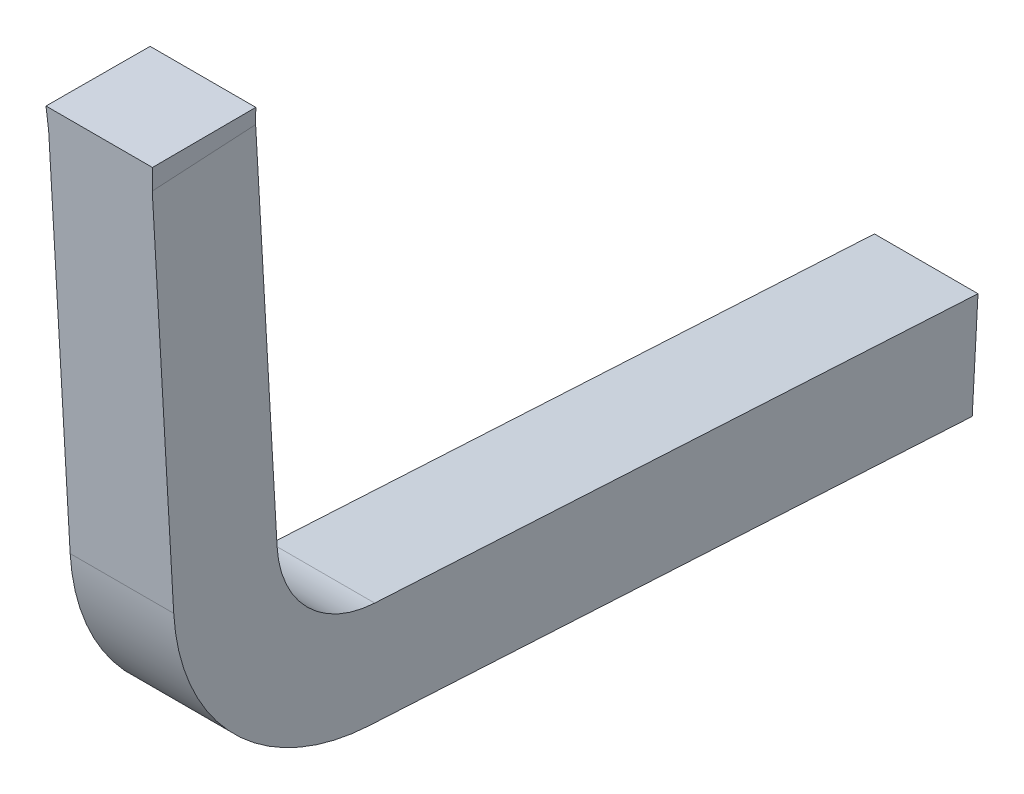
ISO-10303-21;
HEADER;
FILE_DESCRIPTION(('STEP AP214'),'2;1');
FILE_NAME('part.step','',(''),(''),'','','');
FILE_SCHEMA(('AUTOMOTIVE_DESIGN { 1 0 10303 214 1 1 1 1 }'));
ENDSEC;
DATA;
#1=APPLICATION_CONTEXT('core data for automotive mechanical design processes');
#2=APPLICATION_PROTOCOL_DEFINITION('international standard','automotive_design',2000,#1);
#3=PRODUCT_CONTEXT('',#1,'mechanical');
#4=PRODUCT('Part','Part','',(#3));
#5=PRODUCT_RELATED_PRODUCT_CATEGORY('part','',(#4));
#6=PRODUCT_DEFINITION_FORMATION('','',#4);
#7=PRODUCT_DEFINITION_CONTEXT('part definition',#1,'design');
#8=PRODUCT_DEFINITION('design','',#6,#7);
#9=PRODUCT_DEFINITION_SHAPE('','',#8);
#10=(LENGTH_UNIT() NAMED_UNIT(*) SI_UNIT(.MILLI.,.METRE.));
#11=(NAMED_UNIT(*) PLANE_ANGLE_UNIT() SI_UNIT($,.RADIAN.));
#12=(NAMED_UNIT(*) SI_UNIT($,.STERADIAN.) SOLID_ANGLE_UNIT());
#13=UNCERTAINTY_MEASURE_WITH_UNIT(LENGTH_MEASURE(1.E-05),#10,'distance_accuracy_value','');
#14=(GEOMETRIC_REPRESENTATION_CONTEXT(3) GLOBAL_UNCERTAINTY_ASSIGNED_CONTEXT((#13)) GLOBAL_UNIT_ASSIGNED_CONTEXT((#10,
#11,#12)) REPRESENTATION_CONTEXT('',''));
#15=CARTESIAN_POINT('',(0.,0.,0.));
#16=DIRECTION('',(0.,0.,1.));
#17=DIRECTION('',(1.,0.,0.));
#18=AXIS2_PLACEMENT_3D('',#15,#16,#17);
#19=CARTESIAN_POINT('',(-0.6014068341826,-2.29897527843,-10.34781984343));
#20=DIRECTION('',(0.99778515785658,0.0664110879142587,0.00378763292365092));
#21=DIRECTION('',(-0.0664115642915359,0.997792315127928,0.));
#22=AXIS2_PLACEMENT_3D('',#19,#20,#21);
#23=PLANE('',#22);
#24=DIRECTION('',(0.,-0.0569406083110753,0.998377567418842));
#25=VECTOR('',#24,1.);
#26=CARTESIAN_POINT('',(-0.6,-2.314349492935,-10.44885919008));
#27=LINE('',#26,#25);
#28=CARTESIAN_POINT('',(-0.6,-2.31434949293491,-10.4488591900814));
#29=VERTEX_POINT('',#28);
#30=CARTESIAN_POINT('',(-0.6,-2.32573761459727,-10.2491836765951));
#31=VERTEX_POINT('',#30);
#32=EDGE_CURVE('E98',#29,#31,#27,.T.);
#33=ORIENTED_EDGE('',*,*,#32,.T.);
#34=DIRECTION('',(0.0665190105194865,-0.996166318707669,-0.0568144938542911));
#35=VECTOR('',#34,1.);
#36=CARTESIAN_POINT('',(-0.6028136683652,-2.28360106392498,-10.2467804967704));
#37=LINE('',#36,#35);
#38=CARTESIAN_POINT('',(-0.602813668365199,-2.28360106392499,-10.2467804967704));
#39=VERTEX_POINT('',#38);
#40=EDGE_CURVE('E148',#39,#31,#37,.T.);
#41=ORIENTED_EDGE('',*,*,#40,.F.);
#42=DIRECTION('',(-0.003796013203572,0.,0.999992795115924));
#43=VECTOR('',#42,1.);
#44=CARTESIAN_POINT('',(-0.6020532264888,-2.283601063925,-10.4471055106));
#45=LINE('',#44,#43);
#46=CARTESIAN_POINT('',(-0.6020532264888,-2.28360106392489,-10.4471055106019));
#47=VERTEX_POINT('',#46);
#48=EDGE_CURVE('E161',#47,#39,#45,.T.);
#49=ORIENTED_EDGE('',*,*,#48,.F.);
#50=DIRECTION('',(0.0665190105209189,-0.996166318707655,-0.0568144938528551));
#51=VECTOR('',#50,1.);
#52=CARTESIAN_POINT('',(-0.6020532264888,-2.28360106392483,-10.4471055106029));
#53=LINE('',#52,#51);
#54=EDGE_CURVE('E103',#47,#29,#53,.T.);
#55=ORIENTED_EDGE('',*,*,#54,.T.);
#56=EDGE_LOOP('',(#33,#41,#49,#55));
#57=FACE_BOUND('',#56,.T.);
#58=ADVANCED_FACE('F17',(#57),#23,.F.);
#59=CARTESIAN_POINT('',(-0.5,-2.283601063925,-10.34694300369));
#60=DIRECTION('',(0.,1.,0.));
#61=DIRECTION('',(0.,0.,1.));
#62=AXIS2_PLACEMENT_3D('',#59,#60,#61);
#63=PLANE('',#62);
#64=DIRECTION('',(1.,0.,0.));
#65=VECTOR('',#64,1.);
#66=CARTESIAN_POINT('',(-0.5000000000001,-2.28360106392498,-10.2467804967704));
#67=LINE('',#66,#65);
#68=CARTESIAN_POINT('',(-0.397186331634799,-2.28360106392499,-10.2467804967704));
#69=VERTEX_POINT('',#68);
#70=EDGE_CURVE('E154',#69,#39,#67,.F.);
#71=ORIENTED_EDGE('',*,*,#70,.F.);
#72=DIRECTION('',(0.00379601320391404,0.,0.999992795115923));
#73=VECTOR('',#72,1.);
#74=CARTESIAN_POINT('',(-0.397946773511264,-2.283601063925,-10.4471055106));
#75=LINE('',#74,#73);
#76=CARTESIAN_POINT('',(-0.397946773511276,-2.28360106392495,-10.447105510601));
#77=VERTEX_POINT('',#76);
#78=EDGE_CURVE('E119',#77,#69,#75,.T.);
#79=ORIENTED_EDGE('',*,*,#78,.F.);
#80=DIRECTION('',(1.,0.,0.));
#81=VECTOR('',#80,1.);
#82=CARTESIAN_POINT('',(-0.5000000000001,-2.28360106392483,-10.4471055106029));
#83=LINE('',#82,#81);
#84=EDGE_CURVE('E125',#77,#47,#83,.F.);
#85=ORIENTED_EDGE('',*,*,#84,.T.);
#86=ORIENTED_EDGE('',*,*,#48,.T.);
#87=EDGE_LOOP('',(#71,#79,#85,#86));
#88=FACE_BOUND('',#87,.T.);
#89=ADVANCED_FACE('F243',(#88),#63,.T.);
#90=CARTESIAN_POINT('',(-0.6,-2.909472777839,-11.05227927458));
#91=DIRECTION('',(1.,0.,0.));
#92=DIRECTION('',(0.,0.,-1.));
#93=AXIS2_PLACEMENT_3D('',#90,#91,#92);
#94=PLANE('',#93);
#95=CARTESIAN_POINT('',(-0.6,-3.03,-10.69));
#96=DIRECTION('',(-1.,0.,0.));
#97=DIRECTION('',(0.,0.,1.));
#98=AXIS2_PLACEMENT_3D('',#95,#96,#97);
#99=CIRCLE('',#98,0.4);
#100=CARTESIAN_POINT('',(-0.6,-3.05277624331319,-10.2906489730306));
#101=VERTEX_POINT('',#100);
#102=CARTESIAN_POINT('',(-0.6,-3.42937693582933,-10.6676826720305));
#103=VERTEX_POINT('',#102);
#104=EDGE_CURVE('E142',#101,#103,#99,.F.);
#105=ORIENTED_EDGE('',*,*,#104,.F.);
#106=DIRECTION('',(0.,-0.998377567418718,-0.056940608313261));
#107=VECTOR('',#106,1.);
#108=CARTESIAN_POINT('',(-0.6,-2.668188653621,-10.2687147349));
#109=LINE('',#108,#107);
#110=EDGE_CURVE('E145',#31,#101,#109,.T.);
#111=ORIENTED_EDGE('',*,*,#110,.F.);
#112=ORIENTED_EDGE('',*,*,#32,.F.);
#113=DIRECTION('',(0.,-0.998377567418801,-0.0569406083117901));
#114=VECTOR('',#113,1.);
#115=CARTESIAN_POINT('',(-0.6,-2.662494592804,-10.46871499856));
#116=LINE('',#115,#114);
#117=CARTESIAN_POINT('',(-0.6,-3.04138812167726,-10.4903244865168));
#118=VERTEX_POINT('',#117);
#119=EDGE_CURVE('E92',#29,#118,#116,.T.);
#120=ORIENTED_EDGE('',*,*,#119,.T.);
#121=CARTESIAN_POINT('',(-0.6,-3.03,-10.69));
#122=DIRECTION('',(-1.,0.,0.));
#123=DIRECTION('',(0.,0.,1.));
#124=AXIS2_PLACEMENT_3D('',#121,#122,#123);
#125=CIRCLE('',#124,0.2);
#126=CARTESIAN_POINT('',(-0.6,-3.22968846791482,-10.6788413360177));
#127=VERTEX_POINT('',#126);
#128=EDGE_CURVE('E20',#118,#127,#125,.F.);
#129=ORIENTED_EDGE('',*,*,#128,.T.);
#130=DIRECTION('',(0.,0.0557933199228295,0.998442339572991));
#131=VECTOR('',#130,1.);
#132=CARTESIAN_POINT('',(-0.6,-3.262244863925,-11.26145022621));
#133=LINE('',#132,#131);
#134=CARTESIAN_POINT('',(-0.6,-3.29480125993501,-11.8440591164004));
#135=VERTEX_POINT('',#134);
#136=EDGE_CURVE('E111',#135,#127,#133,.T.);
#137=ORIENTED_EDGE('',*,*,#136,.F.);
#138=DIRECTION('',(0.,-0.998442339574031,0.0557933199042218));
#139=VECTOR('',#138,1.);
#140=CARTESIAN_POINT('',(-0.6,-3.394645493892,-11.83847978441));
#141=LINE('',#140,#139);
#142=CARTESIAN_POINT('',(-0.6,-3.49448972784906,-11.8329004524196));
#143=VERTEX_POINT('',#142);
#144=EDGE_CURVE('E135',#135,#143,#141,.T.);
#145=ORIENTED_EDGE('',*,*,#144,.T.);
#146=DIRECTION('',(0.,0.055793319922371,0.998442339573017));
#147=VECTOR('',#146,1.);
#148=CARTESIAN_POINT('',(-0.6,-3.461933331839,-11.25029156222));
#149=LINE('',#148,#147);
#150=EDGE_CURVE('E140',#143,#103,#149,.T.);
#151=ORIENTED_EDGE('',*,*,#150,.T.);
#152=EDGE_LOOP('',(#105,#111,#112,#120,#129,#137,#145,#151));
#153=FACE_BOUND('',#152,.T.);
#154=ADVANCED_FACE('F95',(#153),#94,.F.);
#155=CARTESIAN_POINT('',(-0.5,-3.262244863925,-11.26145022621));
#156=DIRECTION('',(0.,0.998442339572991,-0.0557933199228295));
#157=DIRECTION('',(0.,0.0557933199228295,0.998442339572991));
#158=AXIS2_PLACEMENT_3D('',#155,#156,#157);
#159=PLANE('',#158);
#160=DIRECTION('',(0.,0.055793319922887,0.998442339572988));
#161=VECTOR('',#160,1.);
#162=CARTESIAN_POINT('',(-0.4,-3.294801259935,-11.8440591164));
#163=LINE('',#162,#161);
#164=CARTESIAN_POINT('',(-0.4,-3.29480125993501,-11.8440591164001));
#165=VERTEX_POINT('',#164);
#166=CARTESIAN_POINT('',(-0.4,-3.2296884679148,-10.6788413360177));
#167=VERTEX_POINT('',#166);
#168=EDGE_CURVE('E129',#165,#167,#163,.T.);
#169=ORIENTED_EDGE('',*,*,#168,.F.);
#170=DIRECTION('',(1.,0.,0.));
#171=VECTOR('',#170,1.);
#172=CARTESIAN_POINT('',(-0.5,-3.29480125993502,-11.8440591164004));
#173=LINE('',#172,#171);
#174=EDGE_CURVE('E126',#165,#135,#173,.F.);
#175=ORIENTED_EDGE('',*,*,#174,.T.);
#176=ORIENTED_EDGE('',*,*,#136,.T.);
#177=DIRECTION('',(-1.,0.,0.));
#178=VECTOR('',#177,1.);
#179=CARTESIAN_POINT('',(-0.396,-3.22968846791485,-10.67884133602));
#180=LINE('',#179,#178);
#181=EDGE_CURVE('E110',#127,#167,#180,.F.);
#182=ORIENTED_EDGE('',*,*,#181,.T.);
#183=EDGE_LOOP('',(#169,#175,#176,#182));
#184=FACE_BOUND('',#183,.T.);
#185=ADVANCED_FACE('F234',(#184),#159,.T.);
#186=CARTESIAN_POINT('',(-0.396,-3.03,-10.69));
#187=DIRECTION('',(-1.,0.,0.));
#188=DIRECTION('',(0.,0.,1.));
#189=AXIS2_PLACEMENT_3D('',#186,#187,#188);
#190=CYLINDRICAL_SURFACE('',#189,0.2);
#191=ORIENTED_EDGE('',*,*,#128,.F.);
#192=DIRECTION('',(1.,0.,0.));
#193=VECTOR('',#192,1.);
#194=CARTESIAN_POINT('',(-0.5000000000001,-3.04138812169214,-10.4903244865176));
#195=LINE('',#194,#193);
#196=CARTESIAN_POINT('',(-0.4,-3.04138812167779,-10.490324486518));
#197=VERTEX_POINT('',#196);
#198=EDGE_CURVE('E102',#118,#197,#195,.T.);
#199=ORIENTED_EDGE('',*,*,#198,.T.);
#200=CARTESIAN_POINT('',(-0.4,-3.03,-10.69));
#201=DIRECTION('',(-1.,0.,0.));
#202=DIRECTION('',(0.,0.,1.));
#203=AXIS2_PLACEMENT_3D('',#200,#201,#202);
#204=CIRCLE('',#203,0.2);
#205=EDGE_CURVE('E185',#167,#197,#204,.T.);
#206=ORIENTED_EDGE('',*,*,#205,.F.);
#207=ORIENTED_EDGE('',*,*,#181,.F.);
#208=EDGE_LOOP('',(#191,#199,#206,#207));
#209=FACE_BOUND('',#208,.T.);
#210=ADVANCED_FACE('F107',(#209),#190,.F.);
#211=CARTESIAN_POINT('',(-0.5000000000001,-2.662494592804,-10.46871499856));
#212=DIRECTION('',(0.,-0.0569406083117901,0.998377567418801));
#213=DIRECTION('',(0.,-0.998377567418801,-0.0569406083117901));
#214=AXIS2_PLACEMENT_3D('',#211,#212,#213);
#215=PLANE('',#214);
#216=DIRECTION('',(0.,0.998377567418456,0.0569406083178453));
#217=VECTOR('',#216,1.);
#218=CARTESIAN_POINT('',(-0.4,-3.041388121692,-10.49032448652));
#219=LINE('',#218,#217);
#220=CARTESIAN_POINT('',(-0.400000000000011,-2.314349492934,-10.44885919008));
#221=VERTEX_POINT('',#220);
#222=EDGE_CURVE('E114',#197,#221,#219,.T.);
#223=ORIENTED_EDGE('',*,*,#222,.F.);
#224=ORIENTED_EDGE('',*,*,#198,.F.);
#225=ORIENTED_EDGE('',*,*,#119,.F.);
#226=ORIENTED_EDGE('',*,*,#54,.F.);
#227=ORIENTED_EDGE('',*,*,#84,.F.);
#228=DIRECTION('',(0.0665190105221076,0.99616631870597,0.0568144938810031));
#229=VECTOR('',#228,1.);
#230=CARTESIAN_POINT('',(-0.400000000000033,-2.314349492934,-10.44885919008));
#231=LINE('',#230,#229);
#232=EDGE_CURVE('E116',#221,#77,#231,.T.);
#233=ORIENTED_EDGE('',*,*,#232,.F.);
#234=EDGE_LOOP('',(#223,#224,#225,#226,#227,#233));
#235=FACE_BOUND('',#234,.T.);
#236=ADVANCED_FACE('F112',(#235),#215,.F.);
#237=CARTESIAN_POINT('',(-0.3985931658174,-2.298975278429,-10.34781984343));
#238=DIRECTION('',(0.99778515785672,-0.0664110879121713,-0.00378763292334908));
#239=DIRECTION('',(0.0664115642894485,0.997792315128067,0.));
#240=AXIS2_PLACEMENT_3D('',#237,#238,#239);
#241=PLANE('',#240);
#242=ORIENTED_EDGE('',*,*,#232,.T.);
#243=ORIENTED_EDGE('',*,*,#78,.T.);
#244=DIRECTION('',(0.0665190105226185,0.996166318707459,0.0568144938543015));
#245=VECTOR('',#244,1.);
#246=CARTESIAN_POINT('',(-0.4,-2.32573761459528,-10.249183676595));
#247=LINE('',#246,#245);
#248=CARTESIAN_POINT('',(-0.4,-2.32573761459509,-10.2491836765983));
#249=VERTEX_POINT('',#248);
#250=EDGE_CURVE('E147',#249,#69,#247,.T.);
#251=ORIENTED_EDGE('',*,*,#250,.F.);
#252=DIRECTION('',(0.,-0.0569406083060912,0.998377567419126));
#253=VECTOR('',#252,1.);
#254=CARTESIAN_POINT('',(-0.4,-2.314349492934,-10.44885919008));
#255=LINE('',#254,#253);
#256=EDGE_CURVE('E200',#221,#249,#255,.T.);
#257=ORIENTED_EDGE('',*,*,#256,.F.);
#258=EDGE_LOOP('',(#242,#243,#251,#257));
#259=FACE_BOUND('',#258,.T.);
#260=ADVANCED_FACE('F258',(#259),#241,.T.);
#261=CARTESIAN_POINT('',(-0.5000000000001,-2.668188653621,-10.2687147349));
#262=DIRECTION('',(0.,-0.056940608313261,0.998377567418718));
#263=DIRECTION('',(0.,-0.998377567418718,-0.056940608313261));
#264=AXIS2_PLACEMENT_3D('',#261,#262,#263);
#265=PLANE('',#264);
#266=ORIENTED_EDGE('',*,*,#250,.T.);
#267=ORIENTED_EDGE('',*,*,#70,.T.);
#268=ORIENTED_EDGE('',*,*,#40,.T.);
#269=ORIENTED_EDGE('',*,*,#110,.T.);
#270=DIRECTION('',(-1.,0.,0.));
#271=VECTOR('',#270,1.);
#272=CARTESIAN_POINT('',(-0.396,-3.05277624330094,-10.2906489730311));
#273=LINE('',#272,#271);
#274=CARTESIAN_POINT('',(-0.4,-3.05277624331214,-10.2906489730312));
#275=VERTEX_POINT('',#274);
#276=EDGE_CURVE('E157',#275,#101,#273,.T.);
#277=ORIENTED_EDGE('',*,*,#276,.F.);
#278=DIRECTION('',(0.,-0.998377567419005,-0.0569406083082185));
#279=VECTOR('',#278,1.);
#280=CARTESIAN_POINT('',(-0.4,-2.325737614595,-10.2491836766));
#281=LINE('',#280,#279);
#282=EDGE_CURVE('E184',#249,#275,#281,.T.);
#283=ORIENTED_EDGE('',*,*,#282,.F.);
#284=EDGE_LOOP('',(#266,#267,#268,#269,#277,#283));
#285=FACE_BOUND('',#284,.T.);
#286=ADVANCED_FACE('F227',(#285),#265,.T.);
#287=CARTESIAN_POINT('',(-0.396,-3.03,-10.69));
#288=DIRECTION('',(-1.,0.,0.));
#289=DIRECTION('',(0.,0.,1.));
#290=AXIS2_PLACEMENT_3D('',#287,#288,#289);
#291=CYLINDRICAL_SURFACE('',#290,0.4);
#292=DIRECTION('',(1.,0.,0.));
#293=VECTOR('',#292,1.);
#294=CARTESIAN_POINT('',(-0.5,-3.4293769358293,-10.66768267203));
#295=LINE('',#294,#293);
#296=CARTESIAN_POINT('',(-0.4,-3.42937693582946,-10.6676826720306));
#297=VERTEX_POINT('',#296);
#298=EDGE_CURVE('E137',#103,#297,#295,.T.);
#299=ORIENTED_EDGE('',*,*,#298,.T.);
#300=CARTESIAN_POINT('',(-0.4,-3.03,-10.69));
#301=DIRECTION('',(-1.,0.,0.));
#302=DIRECTION('',(0.,0.,1.));
#303=AXIS2_PLACEMENT_3D('',#300,#301,#302);
#304=CIRCLE('',#303,0.4);
#305=EDGE_CURVE('E181',#275,#297,#304,.F.);
#306=ORIENTED_EDGE('',*,*,#305,.F.);
#307=ORIENTED_EDGE('',*,*,#276,.T.);
#308=ORIENTED_EDGE('',*,*,#104,.T.);
#309=EDGE_LOOP('',(#299,#306,#307,#308));
#310=FACE_BOUND('',#309,.T.);
#311=ADVANCED_FACE('F220',(#310),#291,.T.);
#312=CARTESIAN_POINT('',(-0.5,-3.461933331839,-11.25029156222));
#313=DIRECTION('',(0.,0.998442339573017,-0.055793319922371));
#314=DIRECTION('',(0.,0.055793319922371,0.998442339573017));
#315=AXIS2_PLACEMENT_3D('',#312,#313,#314);
#316=PLANE('',#315);
#317=ORIENTED_EDGE('',*,*,#298,.F.);
#318=ORIENTED_EDGE('',*,*,#150,.F.);
#319=DIRECTION('',(1.,0.,0.));
#320=VECTOR('',#319,1.);
#321=CARTESIAN_POINT('',(-0.5,-3.49448972784898,-11.8329004524196));
#322=LINE('',#321,#320);
#323=CARTESIAN_POINT('',(-0.4,-3.49448972784899,-11.8329004524199));
#324=VERTEX_POINT('',#323);
#325=EDGE_CURVE('E35',#143,#324,#322,.T.);
#326=ORIENTED_EDGE('',*,*,#325,.T.);
#327=DIRECTION('',(0.,-0.0557933199219327,-0.998442339573042));
#328=VECTOR('',#327,1.);
#329=CARTESIAN_POINT('',(-0.4,-3.429376935829,-10.66768267202));
#330=LINE('',#329,#328);
#331=EDGE_CURVE('E26',#297,#324,#330,.T.);
#332=ORIENTED_EDGE('',*,*,#331,.F.);
#333=EDGE_LOOP('',(#317,#318,#326,#332));
#334=FACE_BOUND('',#333,.T.);
#335=ADVANCED_FACE('F222',(#334),#316,.F.);
#336=CARTESIAN_POINT('',(-0.5,-3.394645493892,-11.83847978441));
#337=DIRECTION('',(0.,0.0557933199042218,0.998442339574031));
#338=DIRECTION('',(0.,-0.998442339574031,0.0557933199042218));
#339=AXIS2_PLACEMENT_3D('',#336,#337,#338);
#340=PLANE('',#339);
#341=DIRECTION('',(0.,0.998442339574254,-0.0557933199002383));
#342=VECTOR('',#341,1.);
#343=CARTESIAN_POINT('',(-0.4,-3.494489727849,-11.83290045242));
#344=LINE('',#343,#342);
#345=EDGE_CURVE('E11',#324,#165,#344,.T.);
#346=ORIENTED_EDGE('',*,*,#345,.F.);
#347=ORIENTED_EDGE('',*,*,#325,.F.);
#348=ORIENTED_EDGE('',*,*,#144,.F.);
#349=ORIENTED_EDGE('',*,*,#174,.F.);
#350=EDGE_LOOP('',(#346,#347,#348,#349));
#351=FACE_BOUND('',#350,.T.);
#352=ADVANCED_FACE('F230',(#351),#340,.F.);
#353=CARTESIAN_POINT('',(-0.4,-2.909472777838,-11.05227927458));
#354=DIRECTION('',(1.,0.,0.));
#355=DIRECTION('',(0.,0.,-1.));
#356=AXIS2_PLACEMENT_3D('',#353,#354,#355);
#357=PLANE('',#356);
#358=ORIENTED_EDGE('',*,*,#331,.T.);
#359=ORIENTED_EDGE('',*,*,#345,.T.);
#360=ORIENTED_EDGE('',*,*,#168,.T.);
#361=ORIENTED_EDGE('',*,*,#205,.T.);
#362=ORIENTED_EDGE('',*,*,#222,.T.);
#363=ORIENTED_EDGE('',*,*,#256,.T.);
#364=ORIENTED_EDGE('',*,*,#282,.T.);
#365=ORIENTED_EDGE('',*,*,#305,.T.);
#366=EDGE_LOOP('',(#358,#359,#360,#361,#362,#363,#364,#365));
#367=FACE_BOUND('',#366,.T.);
#368=ADVANCED_FACE('F224',(#367),#357,.T.);
#369=CLOSED_SHELL('',(#58,#89,#154,#185,#210,#236,#260,#286,#311,#335,#352,#368));
#370=MANIFOLD_SOLID_BREP('B1',#369);
#371=ADVANCED_BREP_SHAPE_REPRESENTATION('',(#18,#370),#14);
#372=SHAPE_DEFINITION_REPRESENTATION(#9,#371);
ENDSEC;
END-ISO-10303-21;
